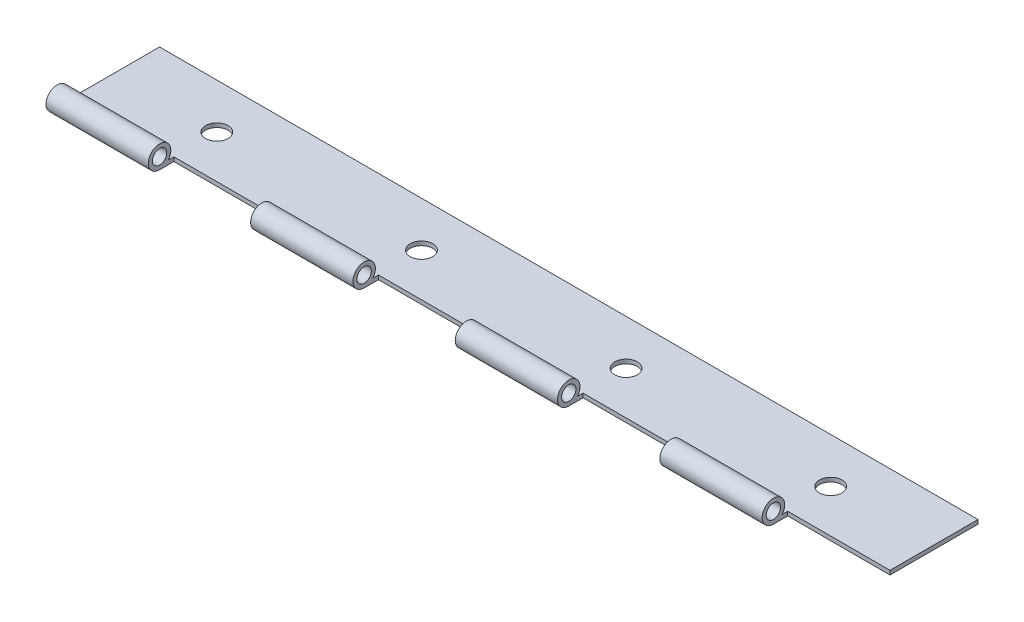
ISO-10303-21;
HEADER;
FILE_DESCRIPTION(('STEP AP214'),'2;1');
FILE_NAME('part.step','',(''),(''),'','','');
FILE_SCHEMA(('AUTOMOTIVE_DESIGN { 1 0 10303 214 1 1 1 1 }'));
ENDSEC;
DATA;
#1=APPLICATION_CONTEXT('core data for automotive mechanical design processes');
#2=APPLICATION_PROTOCOL_DEFINITION('international standard','automotive_design',2000,#1);
#3=PRODUCT_CONTEXT('',#1,'mechanical');
#4=PRODUCT('Part','Part','',(#3));
#5=PRODUCT_RELATED_PRODUCT_CATEGORY('part','',(#4));
#6=PRODUCT_DEFINITION_FORMATION('','',#4);
#7=PRODUCT_DEFINITION_CONTEXT('part definition',#1,'design');
#8=PRODUCT_DEFINITION('design','',#6,#7);
#9=PRODUCT_DEFINITION_SHAPE('','',#8);
#10=(LENGTH_UNIT() NAMED_UNIT(*) SI_UNIT(.MILLI.,.METRE.));
#11=(NAMED_UNIT(*) PLANE_ANGLE_UNIT() SI_UNIT($,.RADIAN.));
#12=(NAMED_UNIT(*) SI_UNIT($,.STERADIAN.) SOLID_ANGLE_UNIT());
#13=UNCERTAINTY_MEASURE_WITH_UNIT(LENGTH_MEASURE(1.E-05),#10,'distance_accuracy_value','');
#14=(GEOMETRIC_REPRESENTATION_CONTEXT(3) GLOBAL_UNCERTAINTY_ASSIGNED_CONTEXT((#13)) GLOBAL_UNIT_ASSIGNED_CONTEXT((#10,
#11,#12)) REPRESENTATION_CONTEXT('',''));
#15=CARTESIAN_POINT('',(0.,0.,0.));
#16=DIRECTION('',(0.,0.,1.));
#17=DIRECTION('',(1.,0.,0.));
#18=AXIS2_PLACEMENT_3D('',#15,#16,#17);
#19=CARTESIAN_POINT('',(101.6,0.,0.));
#20=DIRECTION('',(-1.,0.,0.));
#21=DIRECTION('',(0.,0.,1.));
#22=AXIS2_PLACEMENT_3D('',#19,#20,#21);
#23=CYLINDRICAL_SURFACE('',#22,2.794);
#24=DIRECTION('',(-1.,0.,0.));
#25=VECTOR('',#24,1.);
#26=CARTESIAN_POINT('',(101.6,-1.77800000000001,-2.15526146905659));
#27=LINE('',#26,#25);
#28=CARTESIAN_POINT('',(76.2,-1.77800000000001,-2.15526146905659));
#29=VERTEX_POINT('',#28);
#30=CARTESIAN_POINT('',(50.8,-1.77800000000001,-2.15526146905659));
#31=VERTEX_POINT('',#30);
#32=EDGE_CURVE('E216',#29,#31,#27,.T.);
#33=ORIENTED_EDGE('',*,*,#32,.T.);
#34=CARTESIAN_POINT('',(50.8,0.,0.));
#35=DIRECTION('',(1.,0.,0.));
#36=DIRECTION('',(0.,0.,-1.));
#37=AXIS2_PLACEMENT_3D('',#34,#35,#36);
#38=CIRCLE('',#37,2.794);
#39=CARTESIAN_POINT('',(50.8,-2.794,0.));
#40=VERTEX_POINT('',#39);
#41=EDGE_CURVE('E73',#31,#40,#38,.T.);
#42=ORIENTED_EDGE('',*,*,#41,.T.);
#43=DIRECTION('',(-1.,0.,0.));
#44=VECTOR('',#43,1.);
#45=CARTESIAN_POINT('',(101.6,-2.794,0.));
#46=LINE('',#45,#44);
#47=CARTESIAN_POINT('',(76.2,-2.794,0.));
#48=VERTEX_POINT('',#47);
#49=EDGE_CURVE('E225',#48,#40,#46,.T.);
#50=ORIENTED_EDGE('',*,*,#49,.F.);
#51=CARTESIAN_POINT('',(76.2,0.,0.));
#52=DIRECTION('',(-1.,0.,0.));
#53=DIRECTION('',(0.,0.,1.));
#54=AXIS2_PLACEMENT_3D('',#51,#52,#53);
#55=CIRCLE('',#54,2.794);
#56=EDGE_CURVE('E471',#48,#29,#55,.T.);
#57=ORIENTED_EDGE('',*,*,#56,.T.);
#58=EDGE_LOOP('',(#33,#42,#50,#57));
#59=FACE_BOUND('',#58,.T.);
#60=ADVANCED_FACE('F50',(#59),#23,.T.);
#61=CARTESIAN_POINT('',(101.6,0.,0.));
#62=DIRECTION('',(-1.,0.,0.));
#63=DIRECTION('',(0.,0.,1.));
#64=AXIS2_PLACEMENT_3D('',#61,#62,#63);
#65=CYLINDRICAL_SURFACE('',#64,1.778);
#66=CARTESIAN_POINT('',(25.4,0.,0.));
#67=DIRECTION('',(-1.,0.,0.));
#68=DIRECTION('',(0.,0.,1.));
#69=AXIS2_PLACEMENT_3D('',#66,#67,#68);
#70=CIRCLE('',#69,1.778);
#71=CARTESIAN_POINT('',(25.4,0.,1.778));
#72=VERTEX_POINT('',#71);
#73=EDGE_CURVE('E269',#72,#72,#70,.T.);
#74=ORIENTED_EDGE('',*,*,#73,.F.);
#75=EDGE_LOOP('',(#74));
#76=FACE_BOUND('',#75,.T.);
#77=CARTESIAN_POINT('',(0.,0.,0.));
#78=DIRECTION('',(1.,0.,0.));
#79=DIRECTION('',(0.,0.,-1.));
#80=AXIS2_PLACEMENT_3D('',#77,#78,#79);
#81=CIRCLE('',#80,1.778);
#82=CARTESIAN_POINT('',(0.,0.,-1.778));
#83=VERTEX_POINT('',#82);
#84=EDGE_CURVE('E227',#83,#83,#81,.T.);
#85=ORIENTED_EDGE('',*,*,#84,.F.);
#86=EDGE_LOOP('',(#85));
#87=FACE_BOUND('',#86,.T.);
#88=ADVANCED_FACE('F348',(#76,#87),#65,.F.);
#89=CARTESIAN_POINT('',(-76.2,0.,0.));
#90=DIRECTION('',(-1.,0.,0.));
#91=DIRECTION('',(0.,0.,1.));
#92=AXIS2_PLACEMENT_3D('',#89,#90,#91);
#93=CIRCLE('',#92,1.778);
#94=CARTESIAN_POINT('',(-76.2,0.,1.778));
#95=VERTEX_POINT('',#94);
#96=EDGE_CURVE('E314',#95,#95,#93,.T.);
#97=ORIENTED_EDGE('',*,*,#96,.F.);
#98=EDGE_LOOP('',(#97));
#99=FACE_BOUND('',#98,.T.);
#100=CARTESIAN_POINT('',(-101.6,0.,0.));
#101=DIRECTION('',(1.,0.,0.));
#102=DIRECTION('',(0.,0.,-1.));
#103=AXIS2_PLACEMENT_3D('',#100,#101,#102);
#104=CIRCLE('',#103,1.778);
#105=CARTESIAN_POINT('',(-101.6,0.,-1.778));
#106=VERTEX_POINT('',#105);
#107=EDGE_CURVE('E204',#106,#106,#104,.T.);
#108=ORIENTED_EDGE('',*,*,#107,.F.);
#109=EDGE_LOOP('',(#108));
#110=FACE_BOUND('',#109,.T.);
#111=ADVANCED_FACE('F345',(#99,#110),#65,.F.);
#112=CARTESIAN_POINT('',(-25.4,-1.77800000000001,-2.15526146905659));
#113=VERTEX_POINT('',#112);
#114=CARTESIAN_POINT('',(-50.8,-1.77800000000001,-2.15526146905659));
#115=VERTEX_POINT('',#114);
#116=EDGE_CURVE('E217',#113,#115,#27,.T.);
#117=ORIENTED_EDGE('',*,*,#116,.T.);
#118=CARTESIAN_POINT('',(-50.8,0.,0.));
#119=DIRECTION('',(1.,0.,0.));
#120=DIRECTION('',(0.,0.,-1.));
#121=AXIS2_PLACEMENT_3D('',#118,#119,#120);
#122=CIRCLE('',#121,2.794);
#123=CARTESIAN_POINT('',(-50.8,-2.794,0.));
#124=VERTEX_POINT('',#123);
#125=EDGE_CURVE('E297',#115,#124,#122,.T.);
#126=ORIENTED_EDGE('',*,*,#125,.T.);
#127=CARTESIAN_POINT('',(-25.4,-2.794,0.));
#128=VERTEX_POINT('',#127);
#129=EDGE_CURVE('E226',#128,#124,#46,.T.);
#130=ORIENTED_EDGE('',*,*,#129,.F.);
#131=CARTESIAN_POINT('',(-25.4,0.,0.));
#132=DIRECTION('',(-1.,0.,0.));
#133=DIRECTION('',(0.,0.,1.));
#134=AXIS2_PLACEMENT_3D('',#131,#132,#133);
#135=CIRCLE('',#134,2.794);
#136=EDGE_CURVE('E331',#128,#113,#135,.T.);
#137=ORIENTED_EDGE('',*,*,#136,.T.);
#138=EDGE_LOOP('',(#117,#126,#130,#137));
#139=FACE_BOUND('',#138,.T.);
#140=ADVANCED_FACE('F347',(#139),#23,.T.);
#141=CARTESIAN_POINT('',(25.4,0.,0.));
#142=DIRECTION('',(-1.,0.,0.));
#143=DIRECTION('',(0.,0.,1.));
#144=AXIS2_PLACEMENT_3D('',#141,#142,#143);
#145=CIRCLE('',#144,2.794);
#146=CARTESIAN_POINT('',(25.4,-2.794,0.));
#147=VERTEX_POINT('',#146);
#148=CARTESIAN_POINT('',(25.4,-1.77800000000001,-2.15526146905659));
#149=VERTEX_POINT('',#148);
#150=EDGE_CURVE('E384',#147,#149,#145,.T.);
#151=ORIENTED_EDGE('',*,*,#150,.T.);
#152=CARTESIAN_POINT('',(0.,-1.77800000000001,-2.15526146905659));
#153=VERTEX_POINT('',#152);
#154=EDGE_CURVE('E214',#149,#153,#27,.T.);
#155=ORIENTED_EDGE('',*,*,#154,.T.);
#156=CARTESIAN_POINT('',(0.,0.,0.));
#157=DIRECTION('',(1.,0.,0.));
#158=DIRECTION('',(0.,0.,-1.));
#159=AXIS2_PLACEMENT_3D('',#156,#157,#158);
#160=CIRCLE('',#159,2.794);
#161=CARTESIAN_POINT('',(0.,-2.794,0.));
#162=VERTEX_POINT('',#161);
#163=EDGE_CURVE('E324',#153,#162,#160,.T.);
#164=ORIENTED_EDGE('',*,*,#163,.T.);
#165=EDGE_CURVE('E223',#147,#162,#46,.T.);
#166=ORIENTED_EDGE('',*,*,#165,.F.);
#167=EDGE_LOOP('',(#151,#155,#164,#166));
#168=FACE_BOUND('',#167,.T.);
#169=ADVANCED_FACE('F356',(#168),#23,.T.);
#170=CARTESIAN_POINT('',(-50.8,0.,0.));
#171=DIRECTION('',(1.,0.,0.));
#172=DIRECTION('',(0.,0.,-1.));
#173=AXIS2_PLACEMENT_3D('',#170,#171,#172);
#174=CIRCLE('',#173,1.778);
#175=CARTESIAN_POINT('',(-50.8,0.,-1.778));
#176=VERTEX_POINT('',#175);
#177=EDGE_CURVE('E303',#176,#176,#174,.T.);
#178=ORIENTED_EDGE('',*,*,#177,.F.);
#179=EDGE_LOOP('',(#178));
#180=FACE_BOUND('',#179,.T.);
#181=CARTESIAN_POINT('',(-25.4,0.,0.));
#182=DIRECTION('',(-1.,0.,0.));
#183=DIRECTION('',(0.,0.,1.));
#184=AXIS2_PLACEMENT_3D('',#181,#182,#183);
#185=CIRCLE('',#184,1.778);
#186=CARTESIAN_POINT('',(-25.4,0.,1.778));
#187=VERTEX_POINT('',#186);
#188=EDGE_CURVE('E232',#187,#187,#185,.T.);
#189=ORIENTED_EDGE('',*,*,#188,.F.);
#190=EDGE_LOOP('',(#189));
#191=FACE_BOUND('',#190,.T.);
#192=ADVANCED_FACE('F351',(#180,#191),#65,.F.);
#193=CARTESIAN_POINT('',(101.6,0.,0.));
#194=DIRECTION('',(1.,0.,0.));
#195=DIRECTION('',(0.,0.,-1.));
#196=AXIS2_PLACEMENT_3D('',#193,#194,#195);
#197=PLANE('',#196);
#198=DIRECTION('',(0.,1.,0.));
#199=VECTOR('',#198,1.);
#200=CARTESIAN_POINT('',(101.6,-916.178,-3.55600000000031));
#201=LINE('',#200,#199);
#202=CARTESIAN_POINT('',(101.6,-2.79399999999996,-3.556));
#203=VERTEX_POINT('',#202);
#204=CARTESIAN_POINT('',(101.6,-1.77800000000001,-3.55600000000031));
#205=VERTEX_POINT('',#204);
#206=EDGE_CURVE('E65',#203,#205,#201,.T.);
#207=ORIENTED_EDGE('',*,*,#206,.F.);
#208=DIRECTION('',(0.,0.,-1.));
#209=VECTOR('',#208,1.);
#210=CARTESIAN_POINT('',(101.6,-2.794,0.));
#211=LINE('',#210,#209);
#212=CARTESIAN_POINT('',(101.6,-2.794,-25.4));
#213=VERTEX_POINT('',#212);
#214=EDGE_CURVE('E187',#203,#213,#211,.T.);
#215=ORIENTED_EDGE('',*,*,#214,.T.);
#216=DIRECTION('',(0.,1.,0.));
#217=VECTOR('',#216,1.);
#218=CARTESIAN_POINT('',(101.6,-2.794,-25.4));
#219=LINE('',#218,#217);
#220=CARTESIAN_POINT('',(101.6,-1.778,-25.4));
#221=VERTEX_POINT('',#220);
#222=EDGE_CURVE('E197',#213,#221,#219,.T.);
#223=ORIENTED_EDGE('',*,*,#222,.T.);
#224=DIRECTION('',(0.,0.,1.));
#225=VECTOR('',#224,1.);
#226=CARTESIAN_POINT('',(101.6,-1.778,-25.4));
#227=LINE('',#226,#225);
#228=EDGE_CURVE('E190',#221,#205,#227,.T.);
#229=ORIENTED_EDGE('',*,*,#228,.T.);
#230=EDGE_LOOP('',(#207,#215,#223,#229));
#231=FACE_BOUND('',#230,.T.);
#232=ADVANCED_FACE('F186',(#231),#197,.T.);
#233=CARTESIAN_POINT('',(-101.6,0.,0.));
#234=DIRECTION('',(1.,0.,0.));
#235=DIRECTION('',(0.,0.,-1.));
#236=AXIS2_PLACEMENT_3D('',#233,#234,#235);
#237=PLANE('',#236);
#238=DIRECTION('',(0.,1.,0.));
#239=VECTOR('',#238,1.);
#240=CARTESIAN_POINT('',(-101.6,-2.794,-25.4));
#241=LINE('',#240,#239);
#242=CARTESIAN_POINT('',(-101.6,-2.794,-25.4));
#243=VERTEX_POINT('',#242);
#244=CARTESIAN_POINT('',(-101.6,-1.778,-25.4));
#245=VERTEX_POINT('',#244);
#246=EDGE_CURVE('E201',#243,#245,#241,.T.);
#247=ORIENTED_EDGE('',*,*,#246,.F.);
#248=DIRECTION('',(0.,0.,-1.));
#249=VECTOR('',#248,1.);
#250=CARTESIAN_POINT('',(-101.6,-2.794,0.));
#251=LINE('',#250,#249);
#252=CARTESIAN_POINT('',(-101.6,-2.794,0.));
#253=VERTEX_POINT('',#252);
#254=EDGE_CURVE('E211',#253,#243,#251,.T.);
#255=ORIENTED_EDGE('',*,*,#254,.F.);
#256=CARTESIAN_POINT('',(-101.6,0.,0.));
#257=DIRECTION('',(1.,0.,0.));
#258=DIRECTION('',(0.,0.,-1.));
#259=AXIS2_PLACEMENT_3D('',#256,#257,#258);
#260=CIRCLE('',#259,2.794);
#261=CARTESIAN_POINT('',(-101.6,-1.77800000000001,-2.15526146905659));
#262=VERTEX_POINT('',#261);
#263=EDGE_CURVE('E209',#262,#253,#260,.T.);
#264=ORIENTED_EDGE('',*,*,#263,.F.);
#265=DIRECTION('',(0.,0.,1.));
#266=VECTOR('',#265,1.);
#267=CARTESIAN_POINT('',(-101.6,-1.778,-25.4));
#268=LINE('',#267,#266);
#269=EDGE_CURVE('E198',#245,#262,#268,.T.);
#270=ORIENTED_EDGE('',*,*,#269,.F.);
#271=EDGE_LOOP('',(#247,#255,#264,#270));
#272=FACE_BOUND('',#271,.T.);
#273=ORIENTED_EDGE('',*,*,#107,.T.);
#274=EDGE_LOOP('',(#273));
#275=FACE_BOUND('',#274,.T.);
#276=ADVANCED_FACE('F343',(#272,#275),#237,.F.);
#277=CARTESIAN_POINT('',(-76.2,0.,0.));
#278=DIRECTION('',(-1.,0.,0.));
#279=DIRECTION('',(0.,0.,1.));
#280=AXIS2_PLACEMENT_3D('',#277,#278,#279);
#281=CIRCLE('',#280,2.794);
#282=CARTESIAN_POINT('',(-76.2,-2.794,0.));
#283=VERTEX_POINT('',#282);
#284=CARTESIAN_POINT('',(-76.2,-1.77800000000001,-2.15526146905659));
#285=VERTEX_POINT('',#284);
#286=EDGE_CURVE('E309',#283,#285,#281,.T.);
#287=ORIENTED_EDGE('',*,*,#286,.T.);
#288=EDGE_CURVE('E208',#285,#262,#27,.T.);
#289=ORIENTED_EDGE('',*,*,#288,.T.);
#290=ORIENTED_EDGE('',*,*,#263,.T.);
#291=EDGE_CURVE('E222',#283,#253,#46,.T.);
#292=ORIENTED_EDGE('',*,*,#291,.F.);
#293=EDGE_LOOP('',(#287,#289,#290,#292));
#294=FACE_BOUND('',#293,.T.);
#295=ADVANCED_FACE('F52',(#294),#23,.T.);
#296=CARTESIAN_POINT('',(101.6,-2.794,0.));
#297=DIRECTION('',(0.,1.,0.));
#298=DIRECTION('',(0.,0.,1.));
#299=AXIS2_PLACEMENT_3D('',#296,#297,#298);
#300=PLANE('',#299);
#301=CARTESIAN_POINT('',(76.2,-2.79399999999996,-14.224));
#302=DIRECTION('',(0.,1.,0.));
#303=DIRECTION('',(0.,0.,1.));
#304=AXIS2_PLACEMENT_3D('',#301,#302,#303);
#305=CIRCLE('',#304,2.794);
#306=CARTESIAN_POINT('',(76.2,-2.79399999999996,-11.43));
#307=VERTEX_POINT('',#306);
#308=EDGE_CURVE('E279',#307,#307,#305,.T.);
#309=ORIENTED_EDGE('',*,*,#308,.T.);
#310=EDGE_LOOP('',(#309));
#311=FACE_BOUND('',#310,.T.);
#312=CARTESIAN_POINT('',(25.4,-2.79399999999996,-14.224));
#313=DIRECTION('',(0.,1.,0.));
#314=DIRECTION('',(0.,0.,1.));
#315=AXIS2_PLACEMENT_3D('',#312,#313,#314);
#316=CIRCLE('',#315,2.794);
#317=CARTESIAN_POINT('',(25.4,-2.79399999999996,-11.43));
#318=VERTEX_POINT('',#317);
#319=EDGE_CURVE('E182',#318,#318,#316,.T.);
#320=ORIENTED_EDGE('',*,*,#319,.T.);
#321=EDGE_LOOP('',(#320));
#322=FACE_BOUND('',#321,.T.);
#323=CARTESIAN_POINT('',(-76.2,-2.79399999999996,-14.224));
#324=DIRECTION('',(0.,1.,0.));
#325=DIRECTION('',(0.,0.,1.));
#326=AXIS2_PLACEMENT_3D('',#323,#324,#325);
#327=CIRCLE('',#326,2.794);
#328=CARTESIAN_POINT('',(-76.2,-2.79399999999996,-11.43));
#329=VERTEX_POINT('',#328);
#330=EDGE_CURVE('E249',#329,#329,#327,.T.);
#331=ORIENTED_EDGE('',*,*,#330,.T.);
#332=EDGE_LOOP('',(#331));
#333=FACE_BOUND('',#332,.T.);
#334=CARTESIAN_POINT('',(-25.4,-2.79399999999996,-14.224));
#335=DIRECTION('',(0.,1.,0.));
#336=DIRECTION('',(0.,0.,1.));
#337=AXIS2_PLACEMENT_3D('',#334,#335,#336);
#338=CIRCLE('',#337,2.794);
#339=CARTESIAN_POINT('',(-25.4,-2.79399999999996,-11.43));
#340=VERTEX_POINT('',#339);
#341=EDGE_CURVE('E244',#340,#340,#338,.T.);
#342=ORIENTED_EDGE('',*,*,#341,.T.);
#343=EDGE_LOOP('',(#342));
#344=FACE_BOUND('',#343,.T.);
#345=DIRECTION('',(-1.,0.,0.));
#346=VECTOR('',#345,1.);
#347=CARTESIAN_POINT('',(101.6,-2.794,-3.556));
#348=LINE('',#347,#346);
#349=CARTESIAN_POINT('',(50.8,-2.79399999999996,-3.556));
#350=VERTEX_POINT('',#349);
#351=CARTESIAN_POINT('',(25.4,-2.79399999999996,-3.556));
#352=VERTEX_POINT('',#351);
#353=EDGE_CURVE('E283',#350,#352,#348,.T.);
#354=ORIENTED_EDGE('',*,*,#353,.T.);
#355=DIRECTION('',(0.,0.,1.));
#356=VECTOR('',#355,1.);
#357=CARTESIAN_POINT('',(25.4,-2.794,0.));
#358=LINE('',#357,#356);
#359=EDGE_CURVE('E277',#352,#147,#358,.T.);
#360=ORIENTED_EDGE('',*,*,#359,.T.);
#361=ORIENTED_EDGE('',*,*,#165,.T.);
#362=DIRECTION('',(0.,0.,-1.));
#363=VECTOR('',#362,1.);
#364=CARTESIAN_POINT('',(0.,-2.794,0.));
#365=LINE('',#364,#363);
#366=CARTESIAN_POINT('',(0.,-2.79399999999996,-3.556));
#367=VERTEX_POINT('',#366);
#368=EDGE_CURVE('E236',#162,#367,#365,.T.);
#369=ORIENTED_EDGE('',*,*,#368,.T.);
#370=DIRECTION('',(-1.,0.,0.));
#371=VECTOR('',#370,1.);
#372=CARTESIAN_POINT('',(101.6,-2.794,-3.556));
#373=LINE('',#372,#371);
#374=CARTESIAN_POINT('',(-25.4,-2.79399999999996,-3.556));
#375=VERTEX_POINT('',#374);
#376=EDGE_CURVE('E245',#367,#375,#373,.T.);
#377=ORIENTED_EDGE('',*,*,#376,.T.);
#378=DIRECTION('',(0.,0.,1.));
#379=VECTOR('',#378,1.);
#380=CARTESIAN_POINT('',(-25.4,-2.794,0.));
#381=LINE('',#380,#379);
#382=EDGE_CURVE('E333',#375,#128,#381,.T.);
#383=ORIENTED_EDGE('',*,*,#382,.T.);
#384=ORIENTED_EDGE('',*,*,#129,.T.);
#385=DIRECTION('',(0.,0.,-1.));
#386=VECTOR('',#385,1.);
#387=CARTESIAN_POINT('',(-50.8,-2.794,0.));
#388=LINE('',#387,#386);
#389=CARTESIAN_POINT('',(-50.8,-2.79399999999996,-3.556));
#390=VERTEX_POINT('',#389);
#391=EDGE_CURVE('E300',#124,#390,#388,.T.);
#392=ORIENTED_EDGE('',*,*,#391,.T.);
#393=DIRECTION('',(-1.,0.,0.));
#394=VECTOR('',#393,1.);
#395=CARTESIAN_POINT('',(101.6,-2.794,-3.556));
#396=LINE('',#395,#394);
#397=CARTESIAN_POINT('',(-76.2,-2.79399999999996,-3.556));
#398=VERTEX_POINT('',#397);
#399=EDGE_CURVE('E306',#390,#398,#396,.T.);
#400=ORIENTED_EDGE('',*,*,#399,.T.);
#401=DIRECTION('',(0.,0.,1.));
#402=VECTOR('',#401,1.);
#403=CARTESIAN_POINT('',(-76.2,-2.794,0.));
#404=LINE('',#403,#402);
#405=EDGE_CURVE('E311',#398,#283,#404,.T.);
#406=ORIENTED_EDGE('',*,*,#405,.T.);
#407=ORIENTED_EDGE('',*,*,#291,.T.);
#408=ORIENTED_EDGE('',*,*,#254,.T.);
#409=DIRECTION('',(-1.,0.,0.));
#410=VECTOR('',#409,1.);
#411=CARTESIAN_POINT('',(101.6,-2.794,-25.4));
#412=LINE('',#411,#410);
#413=EDGE_CURVE('E195',#213,#243,#412,.T.);
#414=ORIENTED_EDGE('',*,*,#413,.F.);
#415=ORIENTED_EDGE('',*,*,#214,.F.);
#416=DIRECTION('',(-1.,0.,0.));
#417=VECTOR('',#416,1.);
#418=CARTESIAN_POINT('',(101.6,-2.794,-3.556));
#419=LINE('',#418,#417);
#420=CARTESIAN_POINT('',(76.2,-2.79399999999996,-3.556));
#421=VERTEX_POINT('',#420);
#422=EDGE_CURVE('E174',#203,#421,#419,.T.);
#423=ORIENTED_EDGE('',*,*,#422,.T.);
#424=DIRECTION('',(0.,0.,1.));
#425=VECTOR('',#424,1.);
#426=CARTESIAN_POINT('',(76.2,-2.794,0.));
#427=LINE('',#426,#425);
#428=EDGE_CURVE('E268',#421,#48,#427,.T.);
#429=ORIENTED_EDGE('',*,*,#428,.T.);
#430=ORIENTED_EDGE('',*,*,#49,.T.);
#431=DIRECTION('',(0.,0.,-1.));
#432=VECTOR('',#431,1.);
#433=CARTESIAN_POINT('',(50.8,-2.794,0.));
#434=LINE('',#433,#432);
#435=EDGE_CURVE('E273',#40,#350,#434,.T.);
#436=ORIENTED_EDGE('',*,*,#435,.T.);
#437=EDGE_LOOP('',(#354,#360,#361,#369,#377,#383,#384,#392,#400,#406,#407,#408,#414,#415,#423,
#429,#430,#436));
#438=FACE_BOUND('',#437,.T.);
#439=ADVANCED_FACE('F193',(#311,#322,#333,#344,#438),#300,.F.);
#440=CARTESIAN_POINT('',(101.6,-2.794,-25.4));
#441=DIRECTION('',(0.,0.,1.));
#442=DIRECTION('',(1.,0.,0.));
#443=AXIS2_PLACEMENT_3D('',#440,#441,#442);
#444=PLANE('',#443);
#445=ORIENTED_EDGE('',*,*,#246,.T.);
#446=DIRECTION('',(-1.,0.,0.));
#447=VECTOR('',#446,1.);
#448=CARTESIAN_POINT('',(101.6,-1.778,-25.4));
#449=LINE('',#448,#447);
#450=EDGE_CURVE('E218',#221,#245,#449,.T.);
#451=ORIENTED_EDGE('',*,*,#450,.F.);
#452=ORIENTED_EDGE('',*,*,#222,.F.);
#453=ORIENTED_EDGE('',*,*,#413,.T.);
#454=EDGE_LOOP('',(#445,#451,#452,#453));
#455=FACE_BOUND('',#454,.T.);
#456=ADVANCED_FACE('F376',(#455),#444,.F.);
#457=CARTESIAN_POINT('',(101.6,-1.778,-25.4));
#458=DIRECTION('',(0.,-1.,0.));
#459=DIRECTION('',(0.,0.,-1.));
#460=AXIS2_PLACEMENT_3D('',#457,#458,#459);
#461=PLANE('',#460);
#462=CARTESIAN_POINT('',(76.2,-1.77799999999995,-14.224));
#463=DIRECTION('',(0.,-1.,0.));
#464=DIRECTION('',(0.,0.,-1.));
#465=AXIS2_PLACEMENT_3D('',#462,#463,#464);
#466=CIRCLE('',#465,2.794);
#467=CARTESIAN_POINT('',(76.2,-1.77799999999995,-17.018));
#468=VERTEX_POINT('',#467);
#469=EDGE_CURVE('E181',#468,#468,#466,.T.);
#470=ORIENTED_EDGE('',*,*,#469,.T.);
#471=EDGE_LOOP('',(#470));
#472=FACE_BOUND('',#471,.T.);
#473=CARTESIAN_POINT('',(25.4,-1.77799999999995,-14.224));
#474=DIRECTION('',(0.,-1.,0.));
#475=DIRECTION('',(0.,0.,-1.));
#476=AXIS2_PLACEMENT_3D('',#473,#474,#475);
#477=CIRCLE('',#476,2.794);
#478=CARTESIAN_POINT('',(25.4,-1.77799999999995,-17.018));
#479=VERTEX_POINT('',#478);
#480=EDGE_CURVE('E274',#479,#479,#477,.T.);
#481=ORIENTED_EDGE('',*,*,#480,.T.);
#482=EDGE_LOOP('',(#481));
#483=FACE_BOUND('',#482,.T.);
#484=CARTESIAN_POINT('',(-76.2,-1.77799999999995,-14.224));
#485=DIRECTION('',(0.,-1.,0.));
#486=DIRECTION('',(0.,0.,-1.));
#487=AXIS2_PLACEMENT_3D('',#484,#485,#486);
#488=CIRCLE('',#487,2.794);
#489=CARTESIAN_POINT('',(-76.2,-1.77799999999995,-17.018));
#490=VERTEX_POINT('',#489);
#491=EDGE_CURVE('E246',#490,#490,#488,.T.);
#492=ORIENTED_EDGE('',*,*,#491,.T.);
#493=EDGE_LOOP('',(#492));
#494=FACE_BOUND('',#493,.T.);
#495=CARTESIAN_POINT('',(-25.4,-1.77799999999995,-14.224));
#496=DIRECTION('',(0.,-1.,0.));
#497=DIRECTION('',(0.,0.,-1.));
#498=AXIS2_PLACEMENT_3D('',#495,#496,#497);
#499=CIRCLE('',#498,2.794);
#500=CARTESIAN_POINT('',(-25.4,-1.77799999999995,-17.018));
#501=VERTEX_POINT('',#500);
#502=EDGE_CURVE('E241',#501,#501,#499,.T.);
#503=ORIENTED_EDGE('',*,*,#502,.T.);
#504=EDGE_LOOP('',(#503));
#505=FACE_BOUND('',#504,.T.);
#506=ORIENTED_EDGE('',*,*,#154,.F.);
#507=DIRECTION('',(0.,0.,-1.));
#508=VECTOR('',#507,1.);
#509=CARTESIAN_POINT('',(25.4,-1.778,-25.4));
#510=LINE('',#509,#508);
#511=CARTESIAN_POINT('',(25.4,-1.77800000000006,-3.556));
#512=VERTEX_POINT('',#511);
#513=EDGE_CURVE('E272',#149,#512,#510,.T.);
#514=ORIENTED_EDGE('',*,*,#513,.T.);
#515=DIRECTION('',(1.,0.,0.));
#516=VECTOR('',#515,1.);
#517=CARTESIAN_POINT('',(101.6,-1.77800000000001,-3.556));
#518=LINE('',#517,#516);
#519=CARTESIAN_POINT('',(50.8,-1.77800000000006,-3.556));
#520=VERTEX_POINT('',#519);
#521=EDGE_CURVE('E12',#512,#520,#518,.T.);
#522=ORIENTED_EDGE('',*,*,#521,.T.);
#523=DIRECTION('',(0.,0.,1.));
#524=VECTOR('',#523,1.);
#525=CARTESIAN_POINT('',(50.8,-1.778,-25.4));
#526=LINE('',#525,#524);
#527=EDGE_CURVE('E267',#520,#31,#526,.T.);
#528=ORIENTED_EDGE('',*,*,#527,.T.);
#529=ORIENTED_EDGE('',*,*,#32,.F.);
#530=DIRECTION('',(0.,0.,-1.));
#531=VECTOR('',#530,1.);
#532=CARTESIAN_POINT('',(76.2,-1.778,-25.4));
#533=LINE('',#532,#531);
#534=CARTESIAN_POINT('',(76.2,-1.77800000000006,-3.556));
#535=VERTEX_POINT('',#534);
#536=EDGE_CURVE('E262',#29,#535,#533,.T.);
#537=ORIENTED_EDGE('',*,*,#536,.T.);
#538=DIRECTION('',(1.,0.,0.));
#539=VECTOR('',#538,1.);
#540=CARTESIAN_POINT('',(101.6,-1.77800000000001,-3.556));
#541=LINE('',#540,#539);
#542=EDGE_CURVE('E58',#535,#205,#541,.T.);
#543=ORIENTED_EDGE('',*,*,#542,.T.);
#544=ORIENTED_EDGE('',*,*,#228,.F.);
#545=ORIENTED_EDGE('',*,*,#450,.T.);
#546=ORIENTED_EDGE('',*,*,#269,.T.);
#547=ORIENTED_EDGE('',*,*,#288,.F.);
#548=DIRECTION('',(0.,0.,-1.));
#549=VECTOR('',#548,1.);
#550=CARTESIAN_POINT('',(-76.2,-1.778,-25.4));
#551=LINE('',#550,#549);
#552=CARTESIAN_POINT('',(-76.2,-1.77800000000006,-3.556));
#553=VERTEX_POINT('',#552);
#554=EDGE_CURVE('E256',#285,#553,#551,.T.);
#555=ORIENTED_EDGE('',*,*,#554,.T.);
#556=DIRECTION('',(1.,0.,0.));
#557=VECTOR('',#556,1.);
#558=CARTESIAN_POINT('',(101.6,-1.77800000000001,-3.556));
#559=LINE('',#558,#557);
#560=CARTESIAN_POINT('',(-50.8,-1.77800000000006,-3.556));
#561=VERTEX_POINT('',#560);
#562=EDGE_CURVE('E253',#553,#561,#559,.T.);
#563=ORIENTED_EDGE('',*,*,#562,.T.);
#564=DIRECTION('',(0.,0.,1.));
#565=VECTOR('',#564,1.);
#566=CARTESIAN_POINT('',(-50.8,-1.778,-25.4));
#567=LINE('',#566,#565);
#568=EDGE_CURVE('E240',#561,#115,#567,.T.);
#569=ORIENTED_EDGE('',*,*,#568,.T.);
#570=ORIENTED_EDGE('',*,*,#116,.F.);
#571=DIRECTION('',(0.,0.,-1.));
#572=VECTOR('',#571,1.);
#573=CARTESIAN_POINT('',(-25.4,-1.778,-25.4));
#574=LINE('',#573,#572);
#575=CARTESIAN_POINT('',(-25.4,-1.77800000000006,-3.556));
#576=VERTEX_POINT('',#575);
#577=EDGE_CURVE('E235',#113,#576,#574,.T.);
#578=ORIENTED_EDGE('',*,*,#577,.T.);
#579=DIRECTION('',(1.,0.,0.));
#580=VECTOR('',#579,1.);
#581=CARTESIAN_POINT('',(101.6,-1.77800000000001,-3.556));
#582=LINE('',#581,#580);
#583=CARTESIAN_POINT('',(0.,-1.77800000000006,-3.556));
#584=VERTEX_POINT('',#583);
#585=EDGE_CURVE('E237',#576,#584,#582,.T.);
#586=ORIENTED_EDGE('',*,*,#585,.T.);
#587=DIRECTION('',(0.,0.,1.));
#588=VECTOR('',#587,1.);
#589=CARTESIAN_POINT('',(0.,-1.778,-25.4));
#590=LINE('',#589,#588);
#591=EDGE_CURVE('E230',#584,#153,#590,.T.);
#592=ORIENTED_EDGE('',*,*,#591,.T.);
#593=EDGE_LOOP('',(#506,#514,#522,#528,#529,#537,#543,#544,#545,#546,#547,#555,#563,#569,#570,
#578,#586,#592));
#594=FACE_BOUND('',#593,.T.);
#595=ADVANCED_FACE('F397',(#472,#483,#494,#505,#594),#461,.F.);
#596=CARTESIAN_POINT('',(-25.4,-916.178,-3.55600000000031));
#597=DIRECTION('',(0.,0.,-1.));
#598=DIRECTION('',(0.,1.,0.));
#599=AXIS2_PLACEMENT_3D('',#596,#597,#598);
#600=PLANE('',#599);
#601=DIRECTION('',(0.,1.,0.));
#602=VECTOR('',#601,1.);
#603=CARTESIAN_POINT('',(0.,-916.178,-3.55600000000031));
#604=LINE('',#603,#602);
#605=EDGE_CURVE('E317',#367,#584,#604,.T.);
#606=ORIENTED_EDGE('',*,*,#605,.T.);
#607=ORIENTED_EDGE('',*,*,#585,.F.);
#608=DIRECTION('',(0.,1.,0.));
#609=VECTOR('',#608,1.);
#610=CARTESIAN_POINT('',(-25.4,-916.178,-3.55600000000031));
#611=LINE('',#610,#609);
#612=EDGE_CURVE('E231',#375,#576,#611,.T.);
#613=ORIENTED_EDGE('',*,*,#612,.F.);
#614=ORIENTED_EDGE('',*,*,#376,.F.);
#615=EDGE_LOOP('',(#606,#607,#613,#614));
#616=FACE_BOUND('',#615,.T.);
#617=ADVANCED_FACE('F403',(#616),#600,.F.);
#618=CARTESIAN_POINT('',(-25.4,-916.178,2.79399999999969));
#619=DIRECTION('',(-1.,0.,0.));
#620=DIRECTION('',(0.,0.,1.));
#621=AXIS2_PLACEMENT_3D('',#618,#619,#620);
#622=PLANE('',#621);
#623=ORIENTED_EDGE('',*,*,#188,.T.);
#624=EDGE_LOOP('',(#623));
#625=FACE_BOUND('',#624,.T.);
#626=ORIENTED_EDGE('',*,*,#612,.T.);
#627=ORIENTED_EDGE('',*,*,#577,.F.);
#628=ORIENTED_EDGE('',*,*,#136,.F.);
#629=ORIENTED_EDGE('',*,*,#382,.F.);
#630=EDGE_LOOP('',(#626,#627,#628,#629));
#631=FACE_BOUND('',#630,.T.);
#632=ADVANCED_FACE('F453',(#625,#631),#622,.F.);
#633=CARTESIAN_POINT('',(0.,-916.178,2.79399999999969));
#634=DIRECTION('',(1.,0.,0.));
#635=DIRECTION('',(0.,0.,-1.));
#636=AXIS2_PLACEMENT_3D('',#633,#634,#635);
#637=PLANE('',#636);
#638=ORIENTED_EDGE('',*,*,#84,.T.);
#639=EDGE_LOOP('',(#638));
#640=FACE_BOUND('',#639,.T.);
#641=ORIENTED_EDGE('',*,*,#163,.F.);
#642=ORIENTED_EDGE('',*,*,#591,.F.);
#643=ORIENTED_EDGE('',*,*,#605,.F.);
#644=ORIENTED_EDGE('',*,*,#368,.F.);
#645=EDGE_LOOP('',(#641,#642,#643,#644));
#646=FACE_BOUND('',#645,.T.);
#647=ADVANCED_FACE('F400',(#640,#646),#637,.F.);
#648=CARTESIAN_POINT('',(-25.4,-916.178,-14.2240000000003));
#649=DIRECTION('',(0.,1.,0.));
#650=DIRECTION('',(0.,0.,1.));
#651=AXIS2_PLACEMENT_3D('',#648,#649,#650);
#652=CYLINDRICAL_SURFACE('',#651,2.794);
#653=ORIENTED_EDGE('',*,*,#502,.F.);
#654=EDGE_LOOP('',(#653));
#655=FACE_BOUND('',#654,.T.);
#656=ORIENTED_EDGE('',*,*,#341,.F.);
#657=EDGE_LOOP('',(#656));
#658=FACE_BOUND('',#657,.T.);
#659=ADVANCED_FACE('F446',(#655,#658),#652,.F.);
#660=CARTESIAN_POINT('',(-76.2,-916.178,-14.2240000000003));
#661=DIRECTION('',(0.,1.,0.));
#662=DIRECTION('',(0.,0.,1.));
#663=AXIS2_PLACEMENT_3D('',#660,#661,#662);
#664=CYLINDRICAL_SURFACE('',#663,2.794);
#665=ORIENTED_EDGE('',*,*,#491,.F.);
#666=EDGE_LOOP('',(#665));
#667=FACE_BOUND('',#666,.T.);
#668=ORIENTED_EDGE('',*,*,#330,.F.);
#669=EDGE_LOOP('',(#668));
#670=FACE_BOUND('',#669,.T.);
#671=ADVANCED_FACE('F442',(#667,#670),#664,.F.);
#672=CARTESIAN_POINT('',(-76.2,-916.178,2.79399999999969));
#673=DIRECTION('',(-1.,0.,0.));
#674=DIRECTION('',(0.,0.,1.));
#675=AXIS2_PLACEMENT_3D('',#672,#673,#674);
#676=PLANE('',#675);
#677=ORIENTED_EDGE('',*,*,#96,.T.);
#678=EDGE_LOOP('',(#677));
#679=FACE_BOUND('',#678,.T.);
#680=DIRECTION('',(0.,1.,0.));
#681=VECTOR('',#680,1.);
#682=CARTESIAN_POINT('',(-76.2,-916.178,-3.55600000000031));
#683=LINE('',#682,#681);
#684=EDGE_CURVE('E250',#398,#553,#683,.T.);
#685=ORIENTED_EDGE('',*,*,#684,.T.);
#686=ORIENTED_EDGE('',*,*,#554,.F.);
#687=ORIENTED_EDGE('',*,*,#286,.F.);
#688=ORIENTED_EDGE('',*,*,#405,.F.);
#689=EDGE_LOOP('',(#685,#686,#687,#688));
#690=FACE_BOUND('',#689,.T.);
#691=ADVANCED_FACE('F435',(#679,#690),#676,.F.);
#692=CARTESIAN_POINT('',(-76.2,-916.178,-3.55600000000031));
#693=DIRECTION('',(0.,0.,-1.));
#694=DIRECTION('',(0.,1.,0.));
#695=AXIS2_PLACEMENT_3D('',#692,#693,#694);
#696=PLANE('',#695);
#697=DIRECTION('',(0.,1.,0.));
#698=VECTOR('',#697,1.);
#699=CARTESIAN_POINT('',(-50.8,-916.178,-3.55600000000031));
#700=LINE('',#699,#698);
#701=EDGE_CURVE('E287',#390,#561,#700,.T.);
#702=ORIENTED_EDGE('',*,*,#701,.T.);
#703=ORIENTED_EDGE('',*,*,#562,.F.);
#704=ORIENTED_EDGE('',*,*,#684,.F.);
#705=ORIENTED_EDGE('',*,*,#399,.F.);
#706=EDGE_LOOP('',(#702,#703,#704,#705));
#707=FACE_BOUND('',#706,.T.);
#708=ADVANCED_FACE('F431',(#707),#696,.F.);
#709=CARTESIAN_POINT('',(-50.8,-916.178,2.79399999999969));
#710=DIRECTION('',(1.,0.,0.));
#711=DIRECTION('',(0.,0.,-1.));
#712=AXIS2_PLACEMENT_3D('',#709,#710,#711);
#713=PLANE('',#712);
#714=ORIENTED_EDGE('',*,*,#177,.T.);
#715=EDGE_LOOP('',(#714));
#716=FACE_BOUND('',#715,.T.);
#717=ORIENTED_EDGE('',*,*,#125,.F.);
#718=ORIENTED_EDGE('',*,*,#568,.F.);
#719=ORIENTED_EDGE('',*,*,#701,.F.);
#720=ORIENTED_EDGE('',*,*,#391,.F.);
#721=EDGE_LOOP('',(#717,#718,#719,#720));
#722=FACE_BOUND('',#721,.T.);
#723=ADVANCED_FACE('F434',(#716,#722),#713,.F.);
#724=CARTESIAN_POINT('',(76.2,-916.178,-3.55600000000031));
#725=DIRECTION('',(0.,0.,-1.));
#726=DIRECTION('',(0.,1.,0.));
#727=AXIS2_PLACEMENT_3D('',#724,#725,#726);
#728=PLANE('',#727);
#729=ORIENTED_EDGE('',*,*,#206,.T.);
#730=ORIENTED_EDGE('',*,*,#542,.F.);
#731=DIRECTION('',(0.,1.,0.));
#732=VECTOR('',#731,1.);
#733=CARTESIAN_POINT('',(76.2,-916.178,-3.55600000000031));
#734=LINE('',#733,#732);
#735=EDGE_CURVE('E177',#421,#535,#734,.T.);
#736=ORIENTED_EDGE('',*,*,#735,.F.);
#737=ORIENTED_EDGE('',*,*,#422,.F.);
#738=EDGE_LOOP('',(#729,#730,#736,#737));
#739=FACE_BOUND('',#738,.T.);
#740=ADVANCED_FACE('F175',(#739),#728,.F.);
#741=CARTESIAN_POINT('',(76.2,-916.178,2.79399999999969));
#742=DIRECTION('',(-1.,0.,0.));
#743=DIRECTION('',(0.,0.,1.));
#744=AXIS2_PLACEMENT_3D('',#741,#742,#743);
#745=PLANE('',#744);
#746=CARTESIAN_POINT('',(76.2,0.,0.));
#747=DIRECTION('',(-1.,0.,0.));
#748=DIRECTION('',(0.,0.,1.));
#749=AXIS2_PLACEMENT_3D('',#746,#747,#748);
#750=CIRCLE('',#749,1.778);
#751=CARTESIAN_POINT('',(76.2,0.,1.778));
#752=VERTEX_POINT('',#751);
#753=EDGE_CURVE('E259',#752,#752,#750,.T.);
#754=ORIENTED_EDGE('',*,*,#753,.T.);
#755=EDGE_LOOP('',(#754));
#756=FACE_BOUND('',#755,.T.);
#757=ORIENTED_EDGE('',*,*,#735,.T.);
#758=ORIENTED_EDGE('',*,*,#536,.F.);
#759=ORIENTED_EDGE('',*,*,#56,.F.);
#760=ORIENTED_EDGE('',*,*,#428,.F.);
#761=EDGE_LOOP('',(#757,#758,#759,#760));
#762=FACE_BOUND('',#761,.T.);
#763=ADVANCED_FACE('F500',(#756,#762),#745,.F.);
#764=CARTESIAN_POINT('',(25.4,-916.178,-3.55600000000031));
#765=DIRECTION('',(0.,0.,-1.));
#766=DIRECTION('',(0.,1.,0.));
#767=AXIS2_PLACEMENT_3D('',#764,#765,#766);
#768=PLANE('',#767);
#769=DIRECTION('',(0.,1.,0.));
#770=VECTOR('',#769,1.);
#771=CARTESIAN_POINT('',(50.8,-916.178,-3.55600000000031));
#772=LINE('',#771,#770);
#773=EDGE_CURVE('E481',#350,#520,#772,.T.);
#774=ORIENTED_EDGE('',*,*,#773,.T.);
#775=ORIENTED_EDGE('',*,*,#521,.F.);
#776=DIRECTION('',(0.,1.,0.));
#777=VECTOR('',#776,1.);
#778=CARTESIAN_POINT('',(25.4,-916.178,-3.55600000000031));
#779=LINE('',#778,#777);
#780=EDGE_CURVE('E263',#352,#512,#779,.T.);
#781=ORIENTED_EDGE('',*,*,#780,.F.);
#782=ORIENTED_EDGE('',*,*,#353,.F.);
#783=EDGE_LOOP('',(#774,#775,#781,#782));
#784=FACE_BOUND('',#783,.T.);
#785=ADVANCED_FACE('F502',(#784),#768,.F.);
#786=CARTESIAN_POINT('',(25.4,-916.178,2.79399999999969));
#787=DIRECTION('',(-1.,0.,0.));
#788=DIRECTION('',(0.,0.,1.));
#789=AXIS2_PLACEMENT_3D('',#786,#787,#788);
#790=PLANE('',#789);
#791=ORIENTED_EDGE('',*,*,#73,.T.);
#792=EDGE_LOOP('',(#791));
#793=FACE_BOUND('',#792,.T.);
#794=ORIENTED_EDGE('',*,*,#780,.T.);
#795=ORIENTED_EDGE('',*,*,#513,.F.);
#796=ORIENTED_EDGE('',*,*,#150,.F.);
#797=ORIENTED_EDGE('',*,*,#359,.F.);
#798=EDGE_LOOP('',(#794,#795,#796,#797));
#799=FACE_BOUND('',#798,.T.);
#800=ADVANCED_FACE('F393',(#793,#799),#790,.F.);
#801=CARTESIAN_POINT('',(50.8,-916.178,2.79399999999969));
#802=DIRECTION('',(1.,0.,0.));
#803=DIRECTION('',(0.,0.,-1.));
#804=AXIS2_PLACEMENT_3D('',#801,#802,#803);
#805=PLANE('',#804);
#806=CARTESIAN_POINT('',(50.8,0.,0.));
#807=DIRECTION('',(1.,0.,0.));
#808=DIRECTION('',(0.,0.,-1.));
#809=AXIS2_PLACEMENT_3D('',#806,#807,#808);
#810=CIRCLE('',#809,1.778);
#811=CARTESIAN_POINT('',(50.8,0.,-1.778));
#812=VERTEX_POINT('',#811);
#813=EDGE_CURVE('E264',#812,#812,#810,.T.);
#814=ORIENTED_EDGE('',*,*,#813,.T.);
#815=EDGE_LOOP('',(#814));
#816=FACE_BOUND('',#815,.T.);
#817=ORIENTED_EDGE('',*,*,#41,.F.);
#818=ORIENTED_EDGE('',*,*,#527,.F.);
#819=ORIENTED_EDGE('',*,*,#773,.F.);
#820=ORIENTED_EDGE('',*,*,#435,.F.);
#821=EDGE_LOOP('',(#817,#818,#819,#820));
#822=FACE_BOUND('',#821,.T.);
#823=ADVANCED_FACE('F417',(#816,#822),#805,.F.);
#824=CARTESIAN_POINT('',(25.4,-916.178,-14.2240000000003));
#825=DIRECTION('',(0.,1.,0.));
#826=DIRECTION('',(0.,0.,1.));
#827=AXIS2_PLACEMENT_3D('',#824,#825,#826);
#828=CYLINDRICAL_SURFACE('',#827,2.794);
#829=ORIENTED_EDGE('',*,*,#480,.F.);
#830=EDGE_LOOP('',(#829));
#831=FACE_BOUND('',#830,.T.);
#832=ORIENTED_EDGE('',*,*,#319,.F.);
#833=EDGE_LOOP('',(#832));
#834=FACE_BOUND('',#833,.T.);
#835=ADVANCED_FACE('F414',(#831,#834),#828,.F.);
#836=CARTESIAN_POINT('',(76.2,-916.178,-14.2240000000003));
#837=DIRECTION('',(0.,1.,0.));
#838=DIRECTION('',(0.,0.,1.));
#839=AXIS2_PLACEMENT_3D('',#836,#837,#838);
#840=CYLINDRICAL_SURFACE('',#839,2.794);
#841=ORIENTED_EDGE('',*,*,#469,.F.);
#842=EDGE_LOOP('',(#841));
#843=FACE_BOUND('',#842,.T.);
#844=ORIENTED_EDGE('',*,*,#308,.F.);
#845=EDGE_LOOP('',(#844));
#846=FACE_BOUND('',#845,.T.);
#847=ADVANCED_FACE('F416',(#843,#846),#840,.F.);
#848=ORIENTED_EDGE('',*,*,#813,.F.);
#849=EDGE_LOOP('',(#848));
#850=FACE_BOUND('',#849,.T.);
#851=ORIENTED_EDGE('',*,*,#753,.F.);
#852=EDGE_LOOP('',(#851));
#853=FACE_BOUND('',#852,.T.);
#854=ADVANCED_FACE('F359',(#850,#853),#65,.F.);
#855=CLOSED_SHELL('',(#60,#88,#111,#140,#169,#192,#232,#276,#295,#439,#456,#595,#617,#632,#647,
#659,#671,#691,#708,#723,#740,#763,#785,#800,#823,#835,#847,#854));
#856=MANIFOLD_SOLID_BREP('B2',#855);
#857=ADVANCED_BREP_SHAPE_REPRESENTATION('',(#18,#856),#14);
#858=SHAPE_DEFINITION_REPRESENTATION(#9,#857);
ENDSEC;
END-ISO-10303-21;
